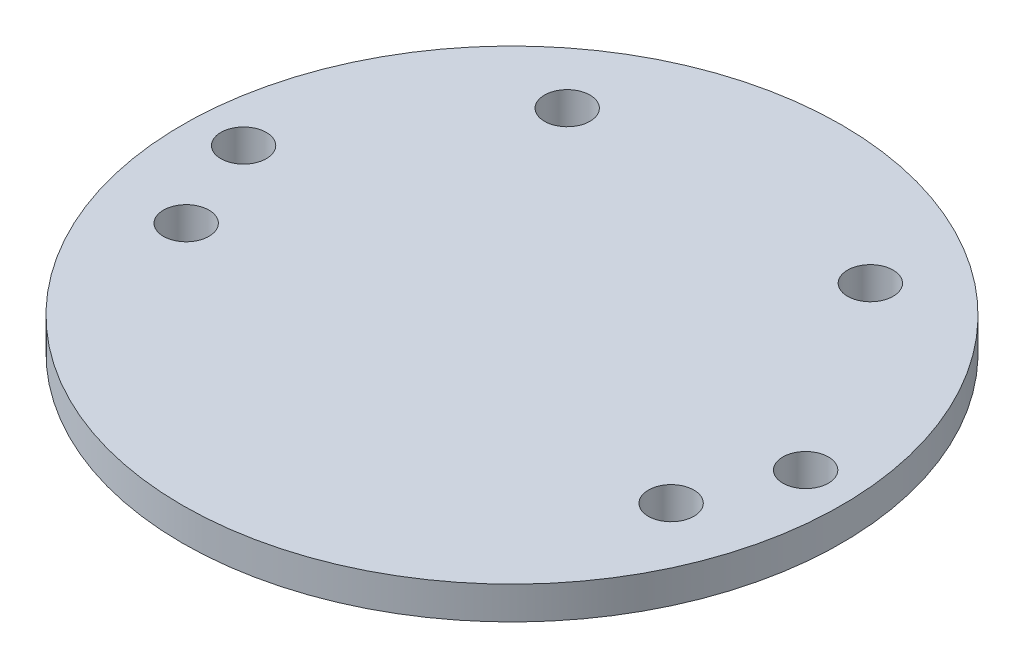
ISO-10303-21;
HEADER;
FILE_DESCRIPTION(('STEP AP214'),'2;1');
FILE_NAME('part.step','',(''),(''),'','','');
FILE_SCHEMA(('AUTOMOTIVE_DESIGN { 1 0 10303 214 1 1 1 1 }'));
ENDSEC;
DATA;
#1=APPLICATION_CONTEXT('core data for automotive mechanical design processes');
#2=APPLICATION_PROTOCOL_DEFINITION('international standard','automotive_design',2000,#1);
#3=PRODUCT_CONTEXT('',#1,'mechanical');
#4=PRODUCT('Part','Part','',(#3));
#5=PRODUCT_RELATED_PRODUCT_CATEGORY('part','',(#4));
#6=PRODUCT_DEFINITION_FORMATION('','',#4);
#7=PRODUCT_DEFINITION_CONTEXT('part definition',#1,'design');
#8=PRODUCT_DEFINITION('design','',#6,#7);
#9=PRODUCT_DEFINITION_SHAPE('','',#8);
#10=(LENGTH_UNIT() NAMED_UNIT(*) SI_UNIT(.MILLI.,.METRE.));
#11=(NAMED_UNIT(*) PLANE_ANGLE_UNIT() SI_UNIT($,.RADIAN.));
#12=(NAMED_UNIT(*) SI_UNIT($,.STERADIAN.) SOLID_ANGLE_UNIT());
#13=UNCERTAINTY_MEASURE_WITH_UNIT(LENGTH_MEASURE(1.E-05),#10,'distance_accuracy_value','');
#14=(GEOMETRIC_REPRESENTATION_CONTEXT(3) GLOBAL_UNCERTAINTY_ASSIGNED_CONTEXT((#13)) GLOBAL_UNIT_ASSIGNED_CONTEXT((#10,
#11,#12)) REPRESENTATION_CONTEXT('',''));
#15=CARTESIAN_POINT('',(0.,0.,0.));
#16=DIRECTION('',(0.,0.,1.));
#17=DIRECTION('',(1.,0.,0.));
#18=AXIS2_PLACEMENT_3D('',#15,#16,#17);
#19=CARTESIAN_POINT('',(37.0004748256233,5.,12.7186187483685));
#20=DIRECTION('',(0.,-1.,0.));
#21=DIRECTION('',(0.,0.,-1.));
#22=AXIS2_PLACEMENT_3D('',#19,#20,#21);
#23=CYLINDRICAL_SURFACE('',#22,3.475);
#24=CARTESIAN_POINT('',(37.0004748256233,5.,12.7186187483685));
#25=DIRECTION('',(0.,1.,0.));
#26=DIRECTION('',(0.,0.,1.));
#27=AXIS2_PLACEMENT_3D('',#24,#25,#26);
#28=CIRCLE('',#27,3.475);
#29=CARTESIAN_POINT('',(37.0004748256233,5.,16.1936187483685));
#30=VERTEX_POINT('',#29);
#31=EDGE_CURVE('E47',#30,#30,#28,.F.);
#32=ORIENTED_EDGE('',*,*,#31,.F.);
#33=EDGE_LOOP('',(#32));
#34=FACE_BOUND('',#33,.T.);
#35=CARTESIAN_POINT('',(37.0004748256233,0.,12.7186187483685));
#36=DIRECTION('',(0.,1.,0.));
#37=DIRECTION('',(0.,0.,1.));
#38=AXIS2_PLACEMENT_3D('',#35,#36,#37);
#39=CIRCLE('',#38,3.475);
#40=CARTESIAN_POINT('',(37.0004748256233,0.,16.1936187483685));
#41=VERTEX_POINT('',#40);
#42=EDGE_CURVE('E70',#41,#41,#39,.F.);
#43=ORIENTED_EDGE('',*,*,#42,.T.);
#44=EDGE_LOOP('',(#43));
#45=FACE_BOUND('',#44,.T.);
#46=ADVANCED_FACE('F39',(#34,#45),#23,.F.);
#47=CARTESIAN_POINT('',(-23.1297303627879,5.,-31.5565203013999));
#48=DIRECTION('',(0.,-1.,0.));
#49=DIRECTION('',(0.,0.,-1.));
#50=AXIS2_PLACEMENT_3D('',#47,#48,#49);
#51=CYLINDRICAL_SURFACE('',#50,3.475);
#52=CARTESIAN_POINT('',(-23.1297303627879,5.,-31.5565203013999));
#53=DIRECTION('',(0.,1.,0.));
#54=DIRECTION('',(0.,0.,1.));
#55=AXIS2_PLACEMENT_3D('',#52,#53,#54);
#56=CIRCLE('',#55,3.475);
#57=CARTESIAN_POINT('',(-23.1297303627879,5.,-28.0815203013999));
#58=VERTEX_POINT('',#57);
#59=EDGE_CURVE('E52',#58,#58,#56,.T.);
#60=ORIENTED_EDGE('',*,*,#59,.T.);
#61=EDGE_LOOP('',(#60));
#62=FACE_BOUND('',#61,.T.);
#63=CARTESIAN_POINT('',(-23.1297303627879,0.,-31.5565203013999));
#64=DIRECTION('',(0.,1.,0.));
#65=DIRECTION('',(0.,0.,1.));
#66=AXIS2_PLACEMENT_3D('',#63,#64,#65);
#67=CIRCLE('',#66,3.475);
#68=CARTESIAN_POINT('',(-23.1297303627879,0.,-28.0815203013999));
#69=VERTEX_POINT('',#68);
#70=EDGE_CURVE('E68',#69,#69,#67,.T.);
#71=ORIENTED_EDGE('',*,*,#70,.F.);
#72=EDGE_LOOP('',(#71));
#73=FACE_BOUND('',#72,.T.);
#74=ADVANCED_FACE('F94',(#62,#73),#51,.F.);
#75=CARTESIAN_POINT('',(-37.0004748256233,5.,12.7186187483685));
#76=DIRECTION('',(0.,-1.,0.));
#77=DIRECTION('',(0.,0.,-1.));
#78=AXIS2_PLACEMENT_3D('',#75,#76,#77);
#79=CYLINDRICAL_SURFACE('',#78,3.475);
#80=CARTESIAN_POINT('',(-37.0004748256233,5.,12.7186187483685));
#81=DIRECTION('',(0.,1.,0.));
#82=DIRECTION('',(0.,0.,1.));
#83=AXIS2_PLACEMENT_3D('',#80,#81,#82);
#84=CIRCLE('',#83,3.475);
#85=CARTESIAN_POINT('',(-37.0004748256233,5.,16.1936187483685));
#86=VERTEX_POINT('',#85);
#87=EDGE_CURVE('E89',#86,#86,#84,.T.);
#88=ORIENTED_EDGE('',*,*,#87,.T.);
#89=EDGE_LOOP('',(#88));
#90=FACE_BOUND('',#89,.T.);
#91=CARTESIAN_POINT('',(-37.0004748256233,0.,12.7186187483685));
#92=DIRECTION('',(0.,1.,0.));
#93=DIRECTION('',(0.,0.,1.));
#94=AXIS2_PLACEMENT_3D('',#91,#92,#93);
#95=CIRCLE('',#94,3.475);
#96=CARTESIAN_POINT('',(-37.0004748256233,0.,16.1936187483685));
#97=VERTEX_POINT('',#96);
#98=EDGE_CURVE('E65',#97,#97,#95,.T.);
#99=ORIENTED_EDGE('',*,*,#98,.F.);
#100=EDGE_LOOP('',(#99));
#101=FACE_BOUND('',#100,.T.);
#102=ADVANCED_FACE('F110',(#90,#101),#79,.F.);
#103=CARTESIAN_POINT('',(-42.8868203559517,5.,-1.92497785865903));
#104=DIRECTION('',(0.,-1.,0.));
#105=DIRECTION('',(0.,0.,-1.));
#106=AXIS2_PLACEMENT_3D('',#103,#104,#105);
#107=CYLINDRICAL_SURFACE('',#106,3.475);
#108=CARTESIAN_POINT('',(-42.8868203559517,5.,-1.92497785865903));
#109=DIRECTION('',(0.,1.,0.));
#110=DIRECTION('',(0.,0.,1.));
#111=AXIS2_PLACEMENT_3D('',#108,#109,#110);
#112=CIRCLE('',#111,3.475);
#113=CARTESIAN_POINT('',(-42.8868203559517,5.,1.55002214134097));
#114=VERTEX_POINT('',#113);
#115=EDGE_CURVE('E84',#114,#114,#112,.T.);
#116=ORIENTED_EDGE('',*,*,#115,.T.);
#117=EDGE_LOOP('',(#116));
#118=FACE_BOUND('',#117,.T.);
#119=CARTESIAN_POINT('',(-42.8868203559517,0.,-1.92497785865903));
#120=DIRECTION('',(0.,1.,0.));
#121=DIRECTION('',(0.,0.,1.));
#122=AXIS2_PLACEMENT_3D('',#119,#120,#121);
#123=CIRCLE('',#122,3.475);
#124=CARTESIAN_POINT('',(-42.8868203559517,0.,1.55002214134097));
#125=VERTEX_POINT('',#124);
#126=EDGE_CURVE('E62',#125,#125,#123,.T.);
#127=ORIENTED_EDGE('',*,*,#126,.F.);
#128=EDGE_LOOP('',(#127));
#129=FACE_BOUND('',#128,.T.);
#130=ADVANCED_FACE('F117',(#118,#129),#107,.F.);
#131=CARTESIAN_POINT('',(0.,5.,0.));
#132=DIRECTION('',(0.,-1.,0.));
#133=DIRECTION('',(0.,0.,-1.));
#134=AXIS2_PLACEMENT_3D('',#131,#132,#133);
#135=CYLINDRICAL_SURFACE('',#134,50.292);
#136=CARTESIAN_POINT('',(0.,5.,0.));
#137=DIRECTION('',(0.,1.,0.));
#138=DIRECTION('',(0.,0.,1.));
#139=AXIS2_PLACEMENT_3D('',#136,#137,#138);
#140=CIRCLE('',#139,50.292);
#141=CARTESIAN_POINT('',(0.,5.,50.292));
#142=VERTEX_POINT('',#141);
#143=EDGE_CURVE('E79',#142,#142,#140,.T.);
#144=ORIENTED_EDGE('',*,*,#143,.F.);
#145=EDGE_LOOP('',(#144));
#146=FACE_BOUND('',#145,.T.);
#147=CARTESIAN_POINT('',(0.,0.,0.));
#148=DIRECTION('',(0.,1.,0.));
#149=DIRECTION('',(0.,0.,1.));
#150=AXIS2_PLACEMENT_3D('',#147,#148,#149);
#151=CIRCLE('',#150,50.292);
#152=CARTESIAN_POINT('',(0.,0.,50.292));
#153=VERTEX_POINT('',#152);
#154=EDGE_CURVE('E59',#153,#153,#151,.T.);
#155=ORIENTED_EDGE('',*,*,#154,.T.);
#156=EDGE_LOOP('',(#155));
#157=FACE_BOUND('',#156,.T.);
#158=ADVANCED_FACE('F120',(#146,#157),#135,.T.);
#159=CARTESIAN_POINT('',(42.8868203559517,5.,-1.92497785865903));
#160=DIRECTION('',(0.,-1.,0.));
#161=DIRECTION('',(0.,0.,-1.));
#162=AXIS2_PLACEMENT_3D('',#159,#160,#161);
#163=CYLINDRICAL_SURFACE('',#162,3.475);
#164=CARTESIAN_POINT('',(42.8868203559517,5.,-1.92497785865903));
#165=DIRECTION('',(0.,1.,0.));
#166=DIRECTION('',(0.,0.,1.));
#167=AXIS2_PLACEMENT_3D('',#164,#165,#166);
#168=CIRCLE('',#167,3.475);
#169=CARTESIAN_POINT('',(42.8868203559517,5.,1.55002214134097));
#170=VERTEX_POINT('',#169);
#171=EDGE_CURVE('E75',#170,#170,#168,.F.);
#172=ORIENTED_EDGE('',*,*,#171,.F.);
#173=EDGE_LOOP('',(#172));
#174=FACE_BOUND('',#173,.T.);
#175=CARTESIAN_POINT('',(42.8868203559517,0.,-1.92497785865903));
#176=DIRECTION('',(0.,1.,0.));
#177=DIRECTION('',(0.,0.,1.));
#178=AXIS2_PLACEMENT_3D('',#175,#176,#177);
#179=CIRCLE('',#178,3.475);
#180=CARTESIAN_POINT('',(42.8868203559517,0.,1.55002214134097));
#181=VERTEX_POINT('',#180);
#182=EDGE_CURVE('E56',#181,#181,#179,.F.);
#183=ORIENTED_EDGE('',*,*,#182,.T.);
#184=EDGE_LOOP('',(#183));
#185=FACE_BOUND('',#184,.T.);
#186=ADVANCED_FACE('F41',(#174,#185),#163,.F.);
#187=CARTESIAN_POINT('',(23.1297303627879,5.,-31.5565203013999));
#188=DIRECTION('',(0.,-1.,0.));
#189=DIRECTION('',(0.,0.,-1.));
#190=AXIS2_PLACEMENT_3D('',#187,#188,#189);
#191=CYLINDRICAL_SURFACE('',#190,3.475);
#192=CARTESIAN_POINT('',(23.1297303627879,5.,-31.5565203013999));
#193=DIRECTION('',(0.,1.,0.));
#194=DIRECTION('',(0.,0.,1.));
#195=AXIS2_PLACEMENT_3D('',#192,#193,#194);
#196=CIRCLE('',#195,3.475);
#197=CARTESIAN_POINT('',(23.1297303627879,5.,-28.0815203013999));
#198=VERTEX_POINT('',#197);
#199=EDGE_CURVE('E10',#198,#198,#196,.F.);
#200=ORIENTED_EDGE('',*,*,#199,.F.);
#201=EDGE_LOOP('',(#200));
#202=FACE_BOUND('',#201,.T.);
#203=CARTESIAN_POINT('',(23.1297303627879,0.,-31.5565203013999));
#204=DIRECTION('',(0.,1.,0.));
#205=DIRECTION('',(0.,0.,1.));
#206=AXIS2_PLACEMENT_3D('',#203,#204,#205);
#207=CIRCLE('',#206,3.475);
#208=CARTESIAN_POINT('',(23.1297303627879,0.,-28.0815203013999));
#209=VERTEX_POINT('',#208);
#210=EDGE_CURVE('E43',#209,#209,#207,.F.);
#211=ORIENTED_EDGE('',*,*,#210,.T.);
#212=EDGE_LOOP('',(#211));
#213=FACE_BOUND('',#212,.T.);
#214=ADVANCED_FACE('F101',(#202,#213),#191,.F.);
#215=CARTESIAN_POINT('',(0.,5.,0.));
#216=DIRECTION('',(0.,1.,0.));
#217=DIRECTION('',(0.,0.,1.));
#218=AXIS2_PLACEMENT_3D('',#215,#216,#217);
#219=PLANE('',#218);
#220=ORIENTED_EDGE('',*,*,#171,.T.);
#221=EDGE_LOOP('',(#220));
#222=FACE_BOUND('',#221,.T.);
#223=ORIENTED_EDGE('',*,*,#143,.T.);
#224=EDGE_LOOP('',(#223));
#225=FACE_BOUND('',#224,.T.);
#226=ORIENTED_EDGE('',*,*,#115,.F.);
#227=EDGE_LOOP('',(#226));
#228=FACE_BOUND('',#227,.T.);
#229=ORIENTED_EDGE('',*,*,#87,.F.);
#230=EDGE_LOOP('',(#229));
#231=FACE_BOUND('',#230,.T.);
#232=ORIENTED_EDGE('',*,*,#59,.F.);
#233=EDGE_LOOP('',(#232));
#234=FACE_BOUND('',#233,.T.);
#235=ORIENTED_EDGE('',*,*,#31,.T.);
#236=EDGE_LOOP('',(#235));
#237=FACE_BOUND('',#236,.T.);
#238=ORIENTED_EDGE('',*,*,#199,.T.);
#239=EDGE_LOOP('',(#238));
#240=FACE_BOUND('',#239,.T.);
#241=ADVANCED_FACE('F97',(#222,#225,#228,#231,#234,#237,#240),#219,.T.);
#242=CARTESIAN_POINT('',(0.,0.,0.));
#243=DIRECTION('',(0.,1.,0.));
#244=DIRECTION('',(0.,0.,1.));
#245=AXIS2_PLACEMENT_3D('',#242,#243,#244);
#246=PLANE('',#245);
#247=ORIENTED_EDGE('',*,*,#182,.F.);
#248=EDGE_LOOP('',(#247));
#249=FACE_BOUND('',#248,.T.);
#250=ORIENTED_EDGE('',*,*,#154,.F.);
#251=EDGE_LOOP('',(#250));
#252=FACE_BOUND('',#251,.T.);
#253=ORIENTED_EDGE('',*,*,#126,.T.);
#254=EDGE_LOOP('',(#253));
#255=FACE_BOUND('',#254,.T.);
#256=ORIENTED_EDGE('',*,*,#98,.T.);
#257=EDGE_LOOP('',(#256));
#258=FACE_BOUND('',#257,.T.);
#259=ORIENTED_EDGE('',*,*,#70,.T.);
#260=EDGE_LOOP('',(#259));
#261=FACE_BOUND('',#260,.T.);
#262=ORIENTED_EDGE('',*,*,#42,.F.);
#263=EDGE_LOOP('',(#262));
#264=FACE_BOUND('',#263,.T.);
#265=ORIENTED_EDGE('',*,*,#210,.F.);
#266=EDGE_LOOP('',(#265));
#267=FACE_BOUND('',#266,.T.);
#268=ADVANCED_FACE('F100',(#249,#252,#255,#258,#261,#264,#267),#246,.F.);
#269=CLOSED_SHELL('',(#46,#74,#102,#130,#158,#186,#214,#241,#268));
#270=MANIFOLD_SOLID_BREP('B2',#269);
#271=ADVANCED_BREP_SHAPE_REPRESENTATION('',(#18,#270),#14);
#272=SHAPE_DEFINITION_REPRESENTATION(#9,#271);
ENDSEC;
END-ISO-10303-21;
